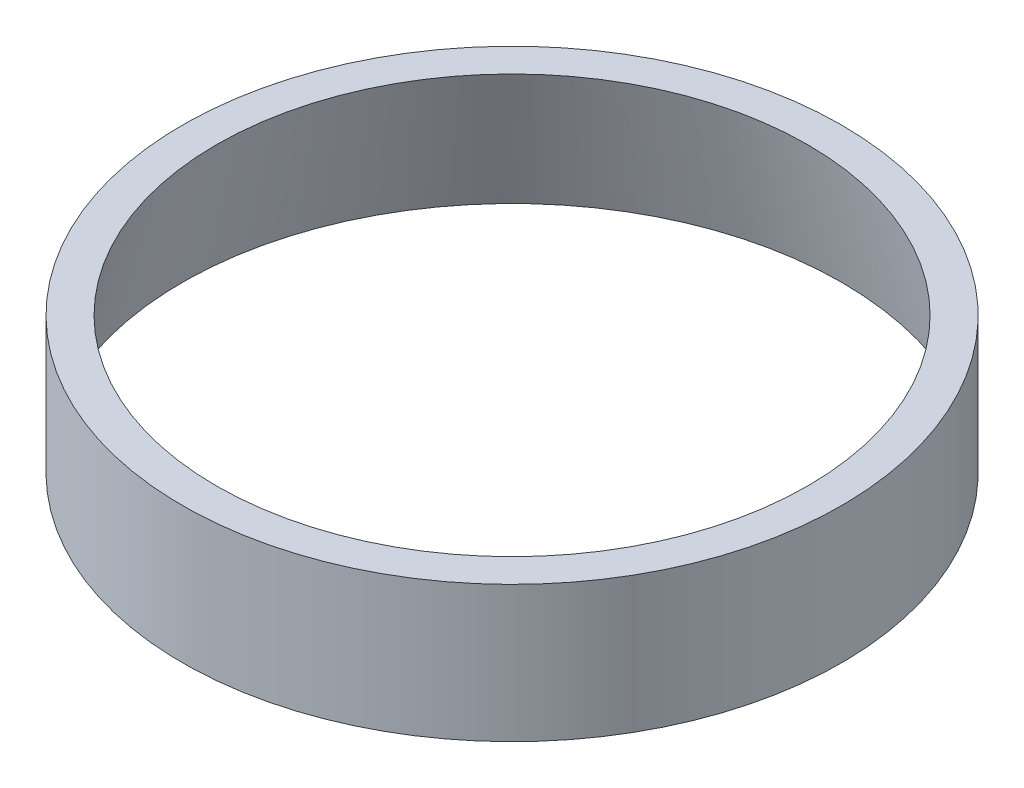
ISO-10303-21;
HEADER;
FILE_DESCRIPTION(('STEP AP214'),'2;1');
FILE_NAME('part.step','',(''),(''),'','','');
FILE_SCHEMA(('AUTOMOTIVE_DESIGN { 1 0 10303 214 1 1 1 1 }'));
ENDSEC;
DATA;
#1=APPLICATION_CONTEXT('core data for automotive mechanical design processes');
#2=APPLICATION_PROTOCOL_DEFINITION('international standard','automotive_design',2000,#1);
#3=PRODUCT_CONTEXT('',#1,'mechanical');
#4=PRODUCT('Part','Part','',(#3));
#5=PRODUCT_RELATED_PRODUCT_CATEGORY('part','',(#4));
#6=PRODUCT_DEFINITION_FORMATION('','',#4);
#7=PRODUCT_DEFINITION_CONTEXT('part definition',#1,'design');
#8=PRODUCT_DEFINITION('design','',#6,#7);
#9=PRODUCT_DEFINITION_SHAPE('','',#8);
#10=(LENGTH_UNIT() NAMED_UNIT(*) SI_UNIT(.MILLI.,.METRE.));
#11=(NAMED_UNIT(*) PLANE_ANGLE_UNIT() SI_UNIT($,.RADIAN.));
#12=(NAMED_UNIT(*) SI_UNIT($,.STERADIAN.) SOLID_ANGLE_UNIT());
#13=UNCERTAINTY_MEASURE_WITH_UNIT(LENGTH_MEASURE(1.E-05),#10,'distance_accuracy_value','');
#14=(GEOMETRIC_REPRESENTATION_CONTEXT(3) GLOBAL_UNCERTAINTY_ASSIGNED_CONTEXT((#13)) GLOBAL_UNIT_ASSIGNED_CONTEXT((#10,
#11,#12)) REPRESENTATION_CONTEXT('',''));
#15=CARTESIAN_POINT('',(0.,0.,0.));
#16=DIRECTION('',(0.,0.,1.));
#17=DIRECTION('',(1.,0.,0.));
#18=AXIS2_PLACEMENT_3D('',#15,#16,#17);
#19=CARTESIAN_POINT('',(0.,0.,0.));
#20=DIRECTION('',(0.,-1.,0.));
#21=DIRECTION('',(0.,0.,-1.));
#22=AXIS2_PLACEMENT_3D('',#19,#20,#21);
#23=CYLINDRICAL_SURFACE('',#22,37.5);
#24=CARTESIAN_POINT('',(0.,15.5,0.));
#25=DIRECTION('',(0.,-1.,0.));
#26=DIRECTION('',(0.,0.,-1.));
#27=AXIS2_PLACEMENT_3D('',#24,#25,#26);
#28=CIRCLE('',#27,37.5);
#29=CARTESIAN_POINT('',(0.,15.5,-37.5));
#30=VERTEX_POINT('',#29);
#31=EDGE_CURVE('E10',#30,#30,#28,.T.);
#32=ORIENTED_EDGE('',*,*,#31,.T.);
#33=EDGE_LOOP('',(#32));
#34=FACE_BOUND('',#33,.T.);
#35=CARTESIAN_POINT('',(0.,0.,0.));
#36=DIRECTION('',(0.,-1.,0.));
#37=DIRECTION('',(0.,0.,-1.));
#38=AXIS2_PLACEMENT_3D('',#35,#36,#37);
#39=CIRCLE('',#38,37.5);
#40=CARTESIAN_POINT('',(0.,0.,-37.5));
#41=VERTEX_POINT('',#40);
#42=EDGE_CURVE('E43',#41,#41,#39,.T.);
#43=ORIENTED_EDGE('',*,*,#42,.F.);
#44=EDGE_LOOP('',(#43));
#45=FACE_BOUND('',#44,.T.);
#46=ADVANCED_FACE('F33',(#34,#45),#23,.T.);
#47=CARTESIAN_POINT('',(33.6354159559306,15.5,0.));
#48=DIRECTION('',(0.,1.,0.));
#49=DIRECTION('',(0.,0.,1.));
#50=AXIS2_PLACEMENT_3D('',#47,#48,#49);
#51=PLANE('',#50);
#52=CARTESIAN_POINT('',(0.,15.5,0.));
#53=DIRECTION('',(0.,-1.,0.));
#54=DIRECTION('',(0.,0.,-1.));
#55=AXIS2_PLACEMENT_3D('',#52,#53,#54);
#56=CIRCLE('',#55,33.6354159559306);
#57=CARTESIAN_POINT('',(0.,15.5,-33.6354159559306));
#58=VERTEX_POINT('',#57);
#59=EDGE_CURVE('E39',#58,#58,#56,.T.);
#60=ORIENTED_EDGE('',*,*,#59,.T.);
#61=EDGE_LOOP('',(#60));
#62=FACE_BOUND('',#61,.T.);
#63=ORIENTED_EDGE('',*,*,#31,.F.);
#64=EDGE_LOOP('',(#63));
#65=FACE_BOUND('',#64,.T.);
#66=ADVANCED_FACE('F54',(#62,#65),#51,.T.);
#67=CARTESIAN_POINT('',(0.,15.5,0.));
#68=DIRECTION('',(0.,-1.,0.));
#69=DIRECTION('',(0.,0.,-1.));
#70=AXIS2_PLACEMENT_3D('',#67,#68,#69);
#71=CONICAL_SURFACE('',#70,33.6354159559306,0.244346095279209);
#72=ORIENTED_EDGE('',*,*,#42,.T.);
#73=EDGE_LOOP('',(#72));
#74=FACE_BOUND('',#73,.T.);
#75=ORIENTED_EDGE('',*,*,#59,.F.);
#76=EDGE_LOOP('',(#75));
#77=FACE_BOUND('',#76,.T.);
#78=ADVANCED_FACE('F50',(#74,#77),#71,.F.);
#79=CLOSED_SHELL('',(#46,#66,#78));
#80=MANIFOLD_SOLID_BREP('B2',#79);
#81=ADVANCED_BREP_SHAPE_REPRESENTATION('',(#18,#80),#14);
#82=SHAPE_DEFINITION_REPRESENTATION(#9,#81);
ENDSEC;
END-ISO-10303-21;
